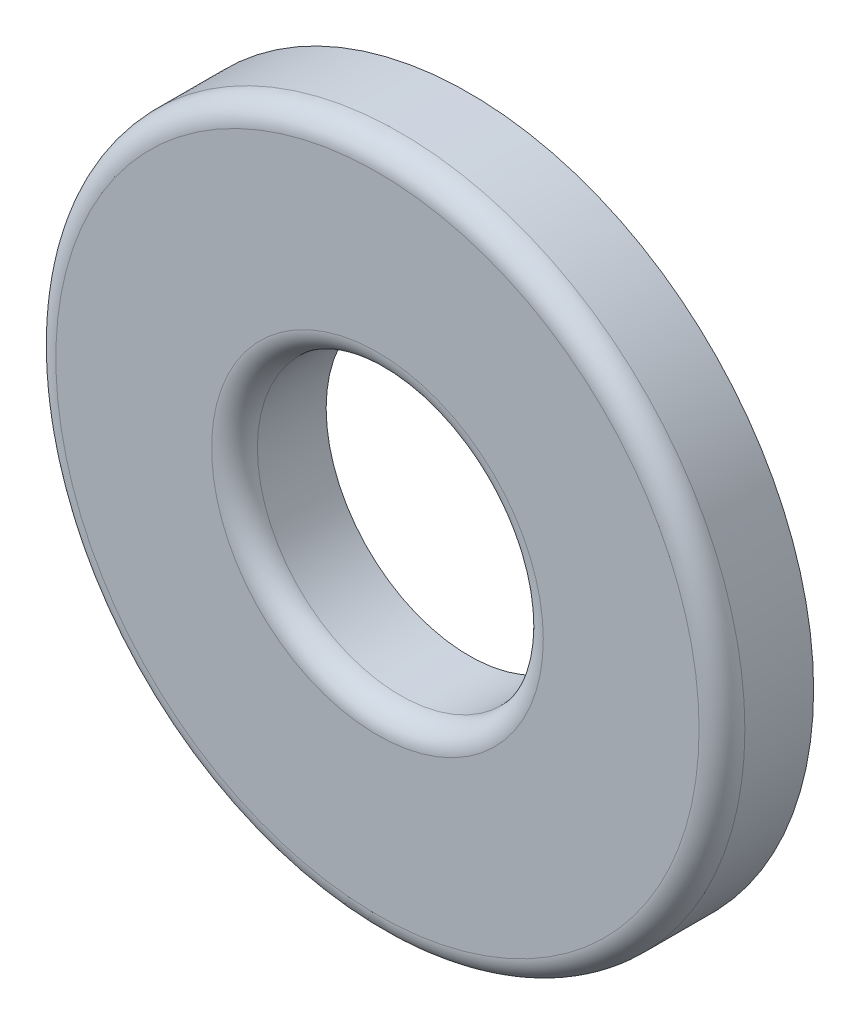
ISO-10303-21;
HEADER;
FILE_DESCRIPTION(('STEP AP214'),'2;1');
FILE_NAME('part.step','',(''),(''),'','','');
FILE_SCHEMA(('AUTOMOTIVE_DESIGN { 1 0 10303 214 1 1 1 1 }'));
ENDSEC;
DATA;
#1=APPLICATION_CONTEXT('core data for automotive mechanical design processes');
#2=APPLICATION_PROTOCOL_DEFINITION('international standard','automotive_design',2000,#1);
#3=PRODUCT_CONTEXT('',#1,'mechanical');
#4=PRODUCT('Part','Part','',(#3));
#5=PRODUCT_RELATED_PRODUCT_CATEGORY('part','',(#4));
#6=PRODUCT_DEFINITION_FORMATION('','',#4);
#7=PRODUCT_DEFINITION_CONTEXT('part definition',#1,'design');
#8=PRODUCT_DEFINITION('design','',#6,#7);
#9=PRODUCT_DEFINITION_SHAPE('','',#8);
#10=(LENGTH_UNIT() NAMED_UNIT(*) SI_UNIT(.MILLI.,.METRE.));
#11=(NAMED_UNIT(*) PLANE_ANGLE_UNIT() SI_UNIT($,.RADIAN.));
#12=(NAMED_UNIT(*) SI_UNIT($,.STERADIAN.) SOLID_ANGLE_UNIT());
#13=UNCERTAINTY_MEASURE_WITH_UNIT(LENGTH_MEASURE(1.E-05),#10,'distance_accuracy_value','');
#14=(GEOMETRIC_REPRESENTATION_CONTEXT(3) GLOBAL_UNCERTAINTY_ASSIGNED_CONTEXT((#13)) GLOBAL_UNIT_ASSIGNED_CONTEXT((#10,
#11,#12)) REPRESENTATION_CONTEXT('',''));
#15=CARTESIAN_POINT('',(0.,0.,0.));
#16=DIRECTION('',(0.,0.,1.));
#17=DIRECTION('',(1.,0.,0.));
#18=AXIS2_PLACEMENT_3D('',#15,#16,#17);
#19=CARTESIAN_POINT('',(0.,0.,0.317499999999996));
#20=DIRECTION('',(0.,0.,1.));
#21=DIRECTION('',(1.,0.,0.));
#22=AXIS2_PLACEMENT_3D('',#19,#20,#21);
#23=PLANE('',#22);
#24=CARTESIAN_POINT('',(0.,0.,0.317499999999996));
#25=DIRECTION('',(0.,0.,1.));
#26=DIRECTION('',(1.,0.,0.));
#27=AXIS2_PLACEMENT_3D('',#24,#25,#26);
#28=CIRCLE('',#27,2.22885);
#29=CARTESIAN_POINT('',(2.22885,0.,0.317499999999996));
#30=VERTEX_POINT('',#29);
#31=EDGE_CURVE('E44',#30,#30,#28,.T.);
#32=ORIENTED_EDGE('',*,*,#31,.T.);
#33=EDGE_LOOP('',(#32));
#34=FACE_BOUND('',#33,.T.);
#35=CARTESIAN_POINT('',(0.,0.,0.317499999999996));
#36=DIRECTION('',(0.,0.,1.));
#37=DIRECTION('',(1.,0.,0.));
#38=AXIS2_PLACEMENT_3D('',#35,#36,#37);
#39=CIRCLE('',#38,1.14935);
#40=CARTESIAN_POINT('',(1.14935,0.,0.317499999999996));
#41=VERTEX_POINT('',#40);
#42=EDGE_CURVE('E48',#41,#41,#39,.F.);
#43=ORIENTED_EDGE('',*,*,#42,.T.);
#44=EDGE_LOOP('',(#43));
#45=FACE_BOUND('',#44,.T.);
#46=ADVANCED_FACE('F33',(#34,#45),#23,.T.);
#47=CARTESIAN_POINT('',(0.,0.,0.317499999999996));
#48=DIRECTION('',(0.,0.,-1.));
#49=DIRECTION('',(-1.,0.,0.));
#50=AXIS2_PLACEMENT_3D('',#47,#48,#49);
#51=CYLINDRICAL_SURFACE('',#50,2.3876);
#52=CARTESIAN_POINT('',(0.,0.,0.158749999999996));
#53=DIRECTION('',(0.,0.,1.));
#54=DIRECTION('',(1.,0.,0.));
#55=AXIS2_PLACEMENT_3D('',#52,#53,#54);
#56=CIRCLE('',#55,2.3876);
#57=CARTESIAN_POINT('',(2.3876,0.,0.158749999999996));
#58=VERTEX_POINT('',#57);
#59=EDGE_CURVE('E40',#58,#58,#56,.F.);
#60=ORIENTED_EDGE('',*,*,#59,.T.);
#61=EDGE_LOOP('',(#60));
#62=FACE_BOUND('',#61,.T.);
#63=CARTESIAN_POINT('',(0.,0.,-0.317500000000004));
#64=DIRECTION('',(0.,0.,1.));
#65=DIRECTION('',(1.,0.,0.));
#66=AXIS2_PLACEMENT_3D('',#63,#64,#65);
#67=CIRCLE('',#66,2.3876);
#68=CARTESIAN_POINT('',(2.3876,0.,-0.317500000000004));
#69=VERTEX_POINT('',#68);
#70=EDGE_CURVE('E53',#69,#69,#67,.T.);
#71=ORIENTED_EDGE('',*,*,#70,.T.);
#72=EDGE_LOOP('',(#71));
#73=FACE_BOUND('',#72,.T.);
#74=ADVANCED_FACE('F65',(#62,#73),#51,.T.);
#75=CARTESIAN_POINT('',(0.,0.,0.317499999999996));
#76=DIRECTION('',(0.,0.,-1.));
#77=DIRECTION('',(-1.,0.,0.));
#78=AXIS2_PLACEMENT_3D('',#75,#76,#77);
#79=CYLINDRICAL_SURFACE('',#78,0.990599999999999);
#80=CARTESIAN_POINT('',(0.,0.,0.158749999999996));
#81=DIRECTION('',(0.,0.,1.));
#82=DIRECTION('',(1.,0.,0.));
#83=AXIS2_PLACEMENT_3D('',#80,#81,#82);
#84=CIRCLE('',#83,0.990599999999999);
#85=CARTESIAN_POINT('',(0.990599999999999,0.,0.158749999999996));
#86=VERTEX_POINT('',#85);
#87=EDGE_CURVE('E10',#86,#86,#84,.T.);
#88=ORIENTED_EDGE('',*,*,#87,.T.);
#89=EDGE_LOOP('',(#88));
#90=FACE_BOUND('',#89,.T.);
#91=CARTESIAN_POINT('',(0.,0.,-0.317500000000004));
#92=DIRECTION('',(0.,0.,1.));
#93=DIRECTION('',(1.,0.,0.));
#94=AXIS2_PLACEMENT_3D('',#91,#92,#93);
#95=CIRCLE('',#94,0.990599999999999);
#96=CARTESIAN_POINT('',(0.990599999999999,0.,-0.317500000000004));
#97=VERTEX_POINT('',#96);
#98=EDGE_CURVE('E56',#97,#97,#95,.T.);
#99=ORIENTED_EDGE('',*,*,#98,.F.);
#100=EDGE_LOOP('',(#99));
#101=FACE_BOUND('',#100,.T.);
#102=ADVANCED_FACE('F63',(#90,#101),#79,.F.);
#103=CARTESIAN_POINT('',(0.,0.,-0.317500000000004));
#104=DIRECTION('',(0.,0.,1.));
#105=DIRECTION('',(1.,0.,0.));
#106=AXIS2_PLACEMENT_3D('',#103,#104,#105);
#107=PLANE('',#106);
#108=ORIENTED_EDGE('',*,*,#98,.T.);
#109=EDGE_LOOP('',(#108));
#110=FACE_BOUND('',#109,.T.);
#111=ORIENTED_EDGE('',*,*,#70,.F.);
#112=EDGE_LOOP('',(#111));
#113=FACE_BOUND('',#112,.T.);
#114=ADVANCED_FACE('F60',(#110,#113),#107,.F.);
#115=CARTESIAN_POINT('',(0.,0.,0.158749999999996));
#116=DIRECTION('',(0.,0.,1.));
#117=DIRECTION('',(1.,0.,0.));
#118=AXIS2_PLACEMENT_3D('',#115,#116,#117);
#119=TOROIDAL_SURFACE('',#118,2.22885,0.15875);
#120=ORIENTED_EDGE('',*,*,#59,.F.);
#121=EDGE_LOOP('',(#120));
#122=FACE_BOUND('',#121,.T.);
#123=ORIENTED_EDGE('',*,*,#31,.F.);
#124=EDGE_LOOP('',(#123));
#125=FACE_BOUND('',#124,.T.);
#126=ADVANCED_FACE('F71',(#122,#125),#119,.T.);
#127=CARTESIAN_POINT('',(0.,0.,0.158749999999996));
#128=DIRECTION('',(0.,0.,1.));
#129=DIRECTION('',(1.,0.,0.));
#130=AXIS2_PLACEMENT_3D('',#127,#128,#129);
#131=TOROIDAL_SURFACE('',#130,1.14935,0.15875);
#132=ORIENTED_EDGE('',*,*,#42,.F.);
#133=EDGE_LOOP('',(#132));
#134=FACE_BOUND('',#133,.T.);
#135=ORIENTED_EDGE('',*,*,#87,.F.);
#136=EDGE_LOOP('',(#135));
#137=FACE_BOUND('',#136,.T.);
#138=ADVANCED_FACE('F35',(#134,#137),#131,.T.);
#139=CLOSED_SHELL('',(#46,#74,#102,#114,#126,#138));
#140=MANIFOLD_SOLID_BREP('B2',#139);
#141=ADVANCED_BREP_SHAPE_REPRESENTATION('',(#18,#140),#14);
#142=SHAPE_DEFINITION_REPRESENTATION(#9,#141);
ENDSEC;
END-ISO-10303-21;
